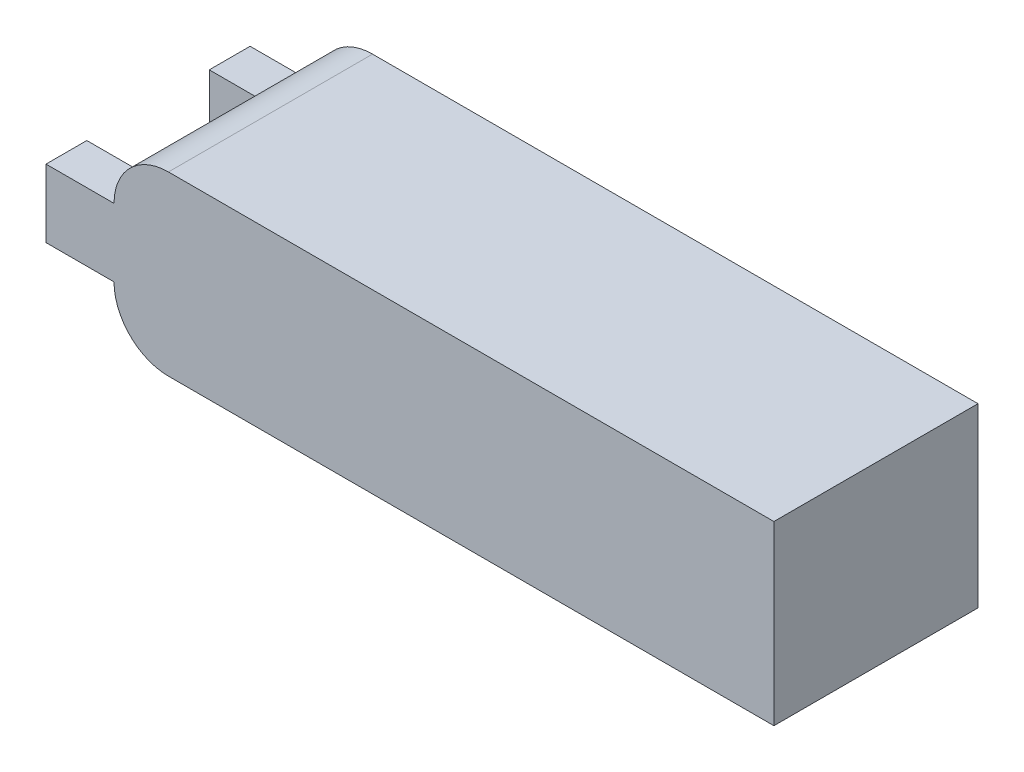
ISO-10303-21;
HEADER;
FILE_DESCRIPTION(('STEP AP214'),'2;1');
FILE_NAME('part.step','',(''),(''),'','','');
FILE_SCHEMA(('AUTOMOTIVE_DESIGN { 1 0 10303 214 1 1 1 1 }'));
ENDSEC;
DATA;
#1=APPLICATION_CONTEXT('core data for automotive mechanical design processes');
#2=APPLICATION_PROTOCOL_DEFINITION('international standard','automotive_design',2000,#1);
#3=PRODUCT_CONTEXT('',#1,'mechanical');
#4=PRODUCT('Part','Part','',(#3));
#5=PRODUCT_RELATED_PRODUCT_CATEGORY('part','',(#4));
#6=PRODUCT_DEFINITION_FORMATION('','',#4);
#7=PRODUCT_DEFINITION_CONTEXT('part definition',#1,'design');
#8=PRODUCT_DEFINITION('design','',#6,#7);
#9=PRODUCT_DEFINITION_SHAPE('','',#8);
#10=(LENGTH_UNIT() NAMED_UNIT(*) SI_UNIT(.MILLI.,.METRE.));
#11=(NAMED_UNIT(*) PLANE_ANGLE_UNIT() SI_UNIT($,.RADIAN.));
#12=(NAMED_UNIT(*) SI_UNIT($,.STERADIAN.) SOLID_ANGLE_UNIT());
#13=UNCERTAINTY_MEASURE_WITH_UNIT(LENGTH_MEASURE(1.E-05),#10,'distance_accuracy_value','');
#14=(GEOMETRIC_REPRESENTATION_CONTEXT(3) GLOBAL_UNCERTAINTY_ASSIGNED_CONTEXT((#13)) GLOBAL_UNIT_ASSIGNED_CONTEXT((#10,
#11,#12)) REPRESENTATION_CONTEXT('',''));
#15=CARTESIAN_POINT('',(0.,0.,0.));
#16=DIRECTION('',(0.,0.,1.));
#17=DIRECTION('',(1.,0.,0.));
#18=AXIS2_PLACEMENT_3D('',#15,#16,#17);
#19=CARTESIAN_POINT('',(0.,26.,0.));
#20=DIRECTION('',(1.,0.,0.));
#21=DIRECTION('',(0.,0.,-1.));
#22=AXIS2_PLACEMENT_3D('',#19,#20,#21);
#23=PLANE('',#22);
#24=DIRECTION('',(0.,-1.,0.));
#25=VECTOR('',#24,1.);
#26=CARTESIAN_POINT('',(0.,18.,-6.));
#27=LINE('',#26,#25);
#28=CARTESIAN_POINT('',(0.,18.,-6.));
#29=VERTEX_POINT('',#28);
#30=CARTESIAN_POINT('',(0.,8.,-6.));
#31=VERTEX_POINT('',#30);
#32=EDGE_CURVE('E282',#29,#31,#27,.T.);
#33=ORIENTED_EDGE('',*,*,#32,.F.);
#34=DIRECTION('',(0.,0.,1.));
#35=VECTOR('',#34,1.);
#36=CARTESIAN_POINT('',(0.,18.,0.));
#37=LINE('',#36,#35);
#38=CARTESIAN_POINT('',(1.2490009027033E-13,18.,-24.));
#39=VERTEX_POINT('',#38);
#40=EDGE_CURVE('E196',#29,#39,#37,.F.);
#41=ORIENTED_EDGE('',*,*,#40,.T.);
#42=DIRECTION('',(0.,1.,0.));
#43=VECTOR('',#42,1.);
#44=CARTESIAN_POINT('',(1.2490009027033E-13,18.,-24.));
#45=LINE('',#44,#43);
#46=CARTESIAN_POINT('',(1.2490009027033E-13,8.,-24.));
#47=VERTEX_POINT('',#46);
#48=EDGE_CURVE('E54',#47,#39,#45,.T.);
#49=ORIENTED_EDGE('',*,*,#48,.F.);
#50=DIRECTION('',(0.,0.,1.));
#51=VECTOR('',#50,1.);
#52=CARTESIAN_POINT('',(0.,8.,0.));
#53=LINE('',#52,#51);
#54=EDGE_CURVE('E199',#47,#31,#53,.T.);
#55=ORIENTED_EDGE('',*,*,#54,.T.);
#56=EDGE_LOOP('',(#33,#41,#49,#55));
#57=FACE_BOUND('',#56,.T.);
#58=ADVANCED_FACE('F32',(#57),#23,.F.);
#59=CARTESIAN_POINT('',(0.,26.,0.));
#60=DIRECTION('',(0.,0.,-1.));
#61=DIRECTION('',(-1.,0.,0.));
#62=AXIS2_PLACEMENT_3D('',#59,#60,#61);
#63=PLANE('',#62);
#64=CARTESIAN_POINT('',(7.99999999999999,18.,0.));
#65=DIRECTION('',(0.,0.,-1.));
#66=DIRECTION('',(-1.,0.,0.));
#67=AXIS2_PLACEMENT_3D('',#64,#65,#66);
#68=CIRCLE('',#67,8.);
#69=CARTESIAN_POINT('',(7.99999999999999,26.,0.));
#70=VERTEX_POINT('',#69);
#71=CARTESIAN_POINT('',(0.,18.,0.));
#72=VERTEX_POINT('',#71);
#73=EDGE_CURVE('E144',#70,#72,#68,.F.);
#74=ORIENTED_EDGE('',*,*,#73,.T.);
#75=DIRECTION('',(1.,0.,0.));
#76=VECTOR('',#75,1.);
#77=CARTESIAN_POINT('',(-9.99999999999999,18.,0.));
#78=LINE('',#77,#76);
#79=CARTESIAN_POINT('',(-9.99999999999999,18.,0.));
#80=VERTEX_POINT('',#79);
#81=EDGE_CURVE('E126',#80,#72,#78,.T.);
#82=ORIENTED_EDGE('',*,*,#81,.F.);
#83=DIRECTION('',(0.,1.,0.));
#84=VECTOR('',#83,1.);
#85=CARTESIAN_POINT('',(-9.99999999999999,18.,0.));
#86=LINE('',#85,#84);
#87=CARTESIAN_POINT('',(-9.99999999999999,8.00000000000001,0.));
#88=VERTEX_POINT('',#87);
#89=EDGE_CURVE('E132',#88,#80,#86,.T.);
#90=ORIENTED_EDGE('',*,*,#89,.F.);
#91=DIRECTION('',(1.,0.,0.));
#92=VECTOR('',#91,1.);
#93=CARTESIAN_POINT('',(-9.99999999999999,8.00000000000001,0.));
#94=LINE('',#93,#92);
#95=CARTESIAN_POINT('',(0.,8.00000000000001,0.));
#96=VERTEX_POINT('',#95);
#97=EDGE_CURVE('E280',#88,#96,#94,.T.);
#98=ORIENTED_EDGE('',*,*,#97,.T.);
#99=CARTESIAN_POINT('',(7.99999999999999,8.,0.));
#100=DIRECTION('',(0.,0.,-1.));
#101=DIRECTION('',(-1.,0.,0.));
#102=AXIS2_PLACEMENT_3D('',#99,#100,#101);
#103=CIRCLE('',#102,8.);
#104=CARTESIAN_POINT('',(7.99999999999999,0.,0.));
#105=VERTEX_POINT('',#104);
#106=EDGE_CURVE('E204',#96,#105,#103,.F.);
#107=ORIENTED_EDGE('',*,*,#106,.T.);
#108=DIRECTION('',(1.,0.,0.));
#109=VECTOR('',#108,1.);
#110=CARTESIAN_POINT('',(0.,0.,0.));
#111=LINE('',#110,#109);
#112=CARTESIAN_POINT('',(97.,0.,0.));
#113=VERTEX_POINT('',#112);
#114=EDGE_CURVE('E176',#105,#113,#111,.T.);
#115=ORIENTED_EDGE('',*,*,#114,.T.);
#116=DIRECTION('',(0.,-1.,0.));
#117=VECTOR('',#116,1.);
#118=CARTESIAN_POINT('',(97.,26.,0.));
#119=LINE('',#118,#117);
#120=CARTESIAN_POINT('',(97.,26.,0.));
#121=VERTEX_POINT('',#120);
#122=EDGE_CURVE('E193',#121,#113,#119,.T.);
#123=ORIENTED_EDGE('',*,*,#122,.F.);
#124=DIRECTION('',(1.,0.,0.));
#125=VECTOR('',#124,1.);
#126=CARTESIAN_POINT('',(0.,26.,0.));
#127=LINE('',#126,#125);
#128=EDGE_CURVE('E177',#70,#121,#127,.T.);
#129=ORIENTED_EDGE('',*,*,#128,.F.);
#130=EDGE_LOOP('',(#74,#82,#90,#98,#107,#115,#123,#129));
#131=FACE_BOUND('',#130,.T.);
#132=ADVANCED_FACE('F142',(#131),#63,.F.);
#133=CARTESIAN_POINT('',(97.,26.,0.));
#134=DIRECTION('',(-1.,0.,0.));
#135=DIRECTION('',(0.,0.,1.));
#136=AXIS2_PLACEMENT_3D('',#133,#134,#135);
#137=PLANE('',#136);
#138=DIRECTION('',(0.,0.,-1.));
#139=VECTOR('',#138,1.);
#140=CARTESIAN_POINT('',(97.,0.,0.));
#141=LINE('',#140,#139);
#142=CARTESIAN_POINT('',(97.,0.,-30.));
#143=VERTEX_POINT('',#142);
#144=EDGE_CURVE('E187',#113,#143,#141,.T.);
#145=ORIENTED_EDGE('',*,*,#144,.T.);
#146=DIRECTION('',(0.,-1.,0.));
#147=VECTOR('',#146,1.);
#148=CARTESIAN_POINT('',(97.,26.,-30.));
#149=LINE('',#148,#147);
#150=CARTESIAN_POINT('',(97.,26.,-30.));
#151=VERTEX_POINT('',#150);
#152=EDGE_CURVE('E185',#151,#143,#149,.T.);
#153=ORIENTED_EDGE('',*,*,#152,.F.);
#154=DIRECTION('',(0.,0.,-1.));
#155=VECTOR('',#154,1.);
#156=CARTESIAN_POINT('',(97.,26.,0.));
#157=LINE('',#156,#155);
#158=EDGE_CURVE('E179',#121,#151,#157,.T.);
#159=ORIENTED_EDGE('',*,*,#158,.F.);
#160=ORIENTED_EDGE('',*,*,#122,.T.);
#161=EDGE_LOOP('',(#145,#153,#159,#160));
#162=FACE_BOUND('',#161,.T.);
#163=ADVANCED_FACE('F249',(#162),#137,.F.);
#164=CARTESIAN_POINT('',(0.,26.,-30.));
#165=DIRECTION('',(0.,0.,1.));
#166=DIRECTION('',(1.,0.,0.));
#167=AXIS2_PLACEMENT_3D('',#164,#165,#166);
#168=PLANE('',#167);
#169=DIRECTION('',(-1.,0.,0.));
#170=VECTOR('',#169,1.);
#171=CARTESIAN_POINT('',(0.,0.,-30.));
#172=LINE('',#171,#170);
#173=CARTESIAN_POINT('',(8.00000000000001,0.,-30.));
#174=VERTEX_POINT('',#173);
#175=EDGE_CURVE('E180',#143,#174,#172,.T.);
#176=ORIENTED_EDGE('',*,*,#175,.T.);
#177=CARTESIAN_POINT('',(8.00000000000001,8.,-30.));
#178=DIRECTION('',(0.,0.,1.));
#179=DIRECTION('',(1.,0.,0.));
#180=AXIS2_PLACEMENT_3D('',#177,#178,#179);
#181=CIRCLE('',#180,8.);
#182=CARTESIAN_POINT('',(0.,8.00000000000001,-30.));
#183=VERTEX_POINT('',#182);
#184=EDGE_CURVE('E40',#174,#183,#181,.F.);
#185=ORIENTED_EDGE('',*,*,#184,.T.);
#186=DIRECTION('',(1.,0.,0.));
#187=VECTOR('',#186,1.);
#188=CARTESIAN_POINT('',(-9.99999999999999,8.00000000000001,-30.));
#189=LINE('',#188,#187);
#190=CARTESIAN_POINT('',(-9.99999999999999,8.00000000000001,-30.));
#191=VERTEX_POINT('',#190);
#192=EDGE_CURVE('E173',#191,#183,#189,.T.);
#193=ORIENTED_EDGE('',*,*,#192,.F.);
#194=DIRECTION('',(0.,-1.,0.));
#195=VECTOR('',#194,1.);
#196=CARTESIAN_POINT('',(-9.99999999999999,18.,-30.));
#197=LINE('',#196,#195);
#198=CARTESIAN_POINT('',(-9.99999999999999,18.,-30.));
#199=VERTEX_POINT('',#198);
#200=EDGE_CURVE('E153',#199,#191,#197,.T.);
#201=ORIENTED_EDGE('',*,*,#200,.F.);
#202=DIRECTION('',(1.,0.,0.));
#203=VECTOR('',#202,1.);
#204=CARTESIAN_POINT('',(-9.99999999999999,18.,-30.));
#205=LINE('',#204,#203);
#206=CARTESIAN_POINT('',(0.,18.,-30.));
#207=VERTEX_POINT('',#206);
#208=EDGE_CURVE('E161',#199,#207,#205,.T.);
#209=ORIENTED_EDGE('',*,*,#208,.T.);
#210=CARTESIAN_POINT('',(8.00000000000001,18.,-30.));
#211=DIRECTION('',(0.,0.,1.));
#212=DIRECTION('',(1.,0.,0.));
#213=AXIS2_PLACEMENT_3D('',#210,#211,#212);
#214=CIRCLE('',#213,8.);
#215=CARTESIAN_POINT('',(8.00000000000001,26.,-30.));
#216=VERTEX_POINT('',#215);
#217=EDGE_CURVE('E208',#207,#216,#214,.F.);
#218=ORIENTED_EDGE('',*,*,#217,.T.);
#219=DIRECTION('',(-1.,0.,0.));
#220=VECTOR('',#219,1.);
#221=CARTESIAN_POINT('',(0.,26.,-30.));
#222=LINE('',#221,#220);
#223=EDGE_CURVE('E182',#151,#216,#222,.T.);
#224=ORIENTED_EDGE('',*,*,#223,.F.);
#225=ORIENTED_EDGE('',*,*,#152,.T.);
#226=EDGE_LOOP('',(#176,#185,#193,#201,#209,#218,#224,#225));
#227=FACE_BOUND('',#226,.T.);
#228=ADVANCED_FACE('F213',(#227),#168,.F.);
#229=CARTESIAN_POINT('',(0.,26.,0.));
#230=DIRECTION('',(0.,-1.,0.));
#231=DIRECTION('',(0.,0.,-1.));
#232=AXIS2_PLACEMENT_3D('',#229,#230,#231);
#233=PLANE('',#232);
#234=ORIENTED_EDGE('',*,*,#223,.T.);
#235=DIRECTION('',(0.,0.,1.));
#236=VECTOR('',#235,1.);
#237=CARTESIAN_POINT('',(7.99999999999999,26.,0.));
#238=LINE('',#237,#236);
#239=EDGE_CURVE('E11',#216,#70,#238,.T.);
#240=ORIENTED_EDGE('',*,*,#239,.T.);
#241=ORIENTED_EDGE('',*,*,#128,.T.);
#242=ORIENTED_EDGE('',*,*,#158,.T.);
#243=EDGE_LOOP('',(#234,#240,#241,#242));
#244=FACE_BOUND('',#243,.T.);
#245=ADVANCED_FACE('F258',(#244),#233,.F.);
#246=CARTESIAN_POINT('',(0.,0.,0.));
#247=DIRECTION('',(0.,-1.,0.));
#248=DIRECTION('',(0.,0.,-1.));
#249=AXIS2_PLACEMENT_3D('',#246,#247,#248);
#250=PLANE('',#249);
#251=ORIENTED_EDGE('',*,*,#114,.F.);
#252=DIRECTION('',(0.,0.,1.));
#253=VECTOR('',#252,1.);
#254=CARTESIAN_POINT('',(8.00000000000001,0.,-30.));
#255=LINE('',#254,#253);
#256=EDGE_CURVE('E206',#105,#174,#255,.F.);
#257=ORIENTED_EDGE('',*,*,#256,.T.);
#258=ORIENTED_EDGE('',*,*,#175,.F.);
#259=ORIENTED_EDGE('',*,*,#144,.F.);
#260=EDGE_LOOP('',(#251,#257,#258,#259));
#261=FACE_BOUND('',#260,.T.);
#262=ADVANCED_FACE('F253',(#261),#250,.T.);
#263=CARTESIAN_POINT('',(7.99999999999999,8.,0.));
#264=DIRECTION('',(0.,0.,-1.));
#265=DIRECTION('',(-1.,0.,0.));
#266=AXIS2_PLACEMENT_3D('',#263,#264,#265);
#267=CYLINDRICAL_SURFACE('',#266,8.);
#268=ORIENTED_EDGE('',*,*,#184,.F.);
#269=ORIENTED_EDGE('',*,*,#256,.F.);
#270=ORIENTED_EDGE('',*,*,#106,.F.);
#271=DIRECTION('',(0.,0.,1.));
#272=VECTOR('',#271,1.);
#273=CARTESIAN_POINT('',(0.,8.00000000000001,0.));
#274=LINE('',#273,#272);
#275=EDGE_CURVE('E47',#31,#96,#274,.T.);
#276=ORIENTED_EDGE('',*,*,#275,.F.);
#277=ORIENTED_EDGE('',*,*,#54,.F.);
#278=EDGE_CURVE('E200',#183,#47,#53,.T.);
#279=ORIENTED_EDGE('',*,*,#278,.F.);
#280=EDGE_LOOP('',(#268,#269,#270,#276,#277,#279));
#281=FACE_BOUND('',#280,.T.);
#282=ADVANCED_FACE('F217',(#281),#267,.T.);
#283=CARTESIAN_POINT('',(7.99999999999999,18.,0.));
#284=DIRECTION('',(0.,0.,1.));
#285=DIRECTION('',(1.,0.,0.));
#286=AXIS2_PLACEMENT_3D('',#283,#284,#285);
#287=CYLINDRICAL_SURFACE('',#286,8.);
#288=ORIENTED_EDGE('',*,*,#217,.F.);
#289=DIRECTION('',(0.,0.,-1.));
#290=VECTOR('',#289,1.);
#291=CARTESIAN_POINT('',(0.,18.,-30.));
#292=LINE('',#291,#290);
#293=EDGE_CURVE('E147',#39,#207,#292,.T.);
#294=ORIENTED_EDGE('',*,*,#293,.F.);
#295=ORIENTED_EDGE('',*,*,#40,.F.);
#296=EDGE_CURVE('E197',#72,#29,#37,.F.);
#297=ORIENTED_EDGE('',*,*,#296,.F.);
#298=ORIENTED_EDGE('',*,*,#73,.F.);
#299=ORIENTED_EDGE('',*,*,#239,.F.);
#300=EDGE_LOOP('',(#288,#294,#295,#297,#298,#299));
#301=FACE_BOUND('',#300,.T.);
#302=ADVANCED_FACE('F34',(#301),#287,.T.);
#303=CARTESIAN_POINT('',(-9.99999999999999,8.00000000000001,-30.));
#304=DIRECTION('',(0.,1.,0.));
#305=DIRECTION('',(0.,0.,1.));
#306=AXIS2_PLACEMENT_3D('',#303,#304,#305);
#307=PLANE('',#306);
#308=ORIENTED_EDGE('',*,*,#278,.T.);
#309=DIRECTION('',(1.,0.,0.));
#310=VECTOR('',#309,1.);
#311=CARTESIAN_POINT('',(-9.99999999999987,8.00000000000001,-24.));
#312=LINE('',#311,#310);
#313=CARTESIAN_POINT('',(-9.99999999999987,8.00000000000001,-24.));
#314=VERTEX_POINT('',#313);
#315=EDGE_CURVE('E170',#314,#47,#312,.T.);
#316=ORIENTED_EDGE('',*,*,#315,.F.);
#317=DIRECTION('',(0.,0.,1.));
#318=VECTOR('',#317,1.);
#319=CARTESIAN_POINT('',(-9.99999999999999,8.00000000000001,-30.));
#320=LINE('',#319,#318);
#321=EDGE_CURVE('E156',#191,#314,#320,.T.);
#322=ORIENTED_EDGE('',*,*,#321,.F.);
#323=ORIENTED_EDGE('',*,*,#192,.T.);
#324=EDGE_LOOP('',(#308,#316,#322,#323));
#325=FACE_BOUND('',#324,.T.);
#326=ADVANCED_FACE('F220',(#325),#307,.F.);
#327=CARTESIAN_POINT('',(-9.99999999999987,18.,-24.));
#328=DIRECTION('',(0.,0.,-1.));
#329=DIRECTION('',(-1.,0.,0.));
#330=AXIS2_PLACEMENT_3D('',#327,#328,#329);
#331=PLANE('',#330);
#332=ORIENTED_EDGE('',*,*,#48,.T.);
#333=DIRECTION('',(1.,0.,0.));
#334=VECTOR('',#333,1.);
#335=CARTESIAN_POINT('',(-9.99999999999987,18.,-24.));
#336=LINE('',#335,#334);
#337=CARTESIAN_POINT('',(-9.99999999999987,18.,-24.));
#338=VERTEX_POINT('',#337);
#339=EDGE_CURVE('E167',#338,#39,#336,.T.);
#340=ORIENTED_EDGE('',*,*,#339,.F.);
#341=DIRECTION('',(0.,1.,0.));
#342=VECTOR('',#341,1.);
#343=CARTESIAN_POINT('',(-9.99999999999987,18.,-24.));
#344=LINE('',#343,#342);
#345=EDGE_CURVE('E158',#314,#338,#344,.T.);
#346=ORIENTED_EDGE('',*,*,#345,.F.);
#347=ORIENTED_EDGE('',*,*,#315,.T.);
#348=EDGE_LOOP('',(#332,#340,#346,#347));
#349=FACE_BOUND('',#348,.T.);
#350=ADVANCED_FACE('F235',(#349),#331,.F.);
#351=CARTESIAN_POINT('',(-9.99999999999999,18.,-30.));
#352=DIRECTION('',(0.,-1.,0.));
#353=DIRECTION('',(0.,0.,-1.));
#354=AXIS2_PLACEMENT_3D('',#351,#352,#353);
#355=PLANE('',#354);
#356=ORIENTED_EDGE('',*,*,#293,.T.);
#357=ORIENTED_EDGE('',*,*,#208,.F.);
#358=DIRECTION('',(0.,0.,-1.));
#359=VECTOR('',#358,1.);
#360=CARTESIAN_POINT('',(-9.99999999999999,18.,-30.));
#361=LINE('',#360,#359);
#362=EDGE_CURVE('E160',#338,#199,#361,.T.);
#363=ORIENTED_EDGE('',*,*,#362,.F.);
#364=ORIENTED_EDGE('',*,*,#339,.T.);
#365=EDGE_LOOP('',(#356,#357,#363,#364));
#366=FACE_BOUND('',#365,.T.);
#367=ADVANCED_FACE('F228',(#366),#355,.F.);
#368=CARTESIAN_POINT('',(-9.99999999999999,0.,0.));
#369=DIRECTION('',(-1.,0.,0.));
#370=DIRECTION('',(0.,0.,1.));
#371=AXIS2_PLACEMENT_3D('',#368,#369,#370);
#372=PLANE('',#371);
#373=ORIENTED_EDGE('',*,*,#200,.T.);
#374=ORIENTED_EDGE('',*,*,#321,.T.);
#375=ORIENTED_EDGE('',*,*,#345,.T.);
#376=ORIENTED_EDGE('',*,*,#362,.T.);
#377=EDGE_LOOP('',(#373,#374,#375,#376));
#378=FACE_BOUND('',#377,.T.);
#379=ADVANCED_FACE('F223',(#378),#372,.T.);
#380=CARTESIAN_POINT('',(-9.99999999999999,18.,0.));
#381=DIRECTION('',(0.,-1.,0.));
#382=DIRECTION('',(0.,0.,-1.));
#383=AXIS2_PLACEMENT_3D('',#380,#381,#382);
#384=PLANE('',#383);
#385=ORIENTED_EDGE('',*,*,#296,.T.);
#386=DIRECTION('',(1.,0.,0.));
#387=VECTOR('',#386,1.);
#388=CARTESIAN_POINT('',(-9.99999999999998,18.,-6.));
#389=LINE('',#388,#387);
#390=CARTESIAN_POINT('',(-9.99999999999998,18.,-6.));
#391=VERTEX_POINT('',#390);
#392=EDGE_CURVE('E128',#391,#29,#389,.T.);
#393=ORIENTED_EDGE('',*,*,#392,.F.);
#394=DIRECTION('',(0.,0.,-1.));
#395=VECTOR('',#394,1.);
#396=CARTESIAN_POINT('',(-9.99999999999999,18.,0.));
#397=LINE('',#396,#395);
#398=EDGE_CURVE('E121',#80,#391,#397,.T.);
#399=ORIENTED_EDGE('',*,*,#398,.F.);
#400=ORIENTED_EDGE('',*,*,#81,.T.);
#401=EDGE_LOOP('',(#385,#393,#399,#400));
#402=FACE_BOUND('',#401,.T.);
#403=ADVANCED_FACE('F124',(#402),#384,.F.);
#404=CARTESIAN_POINT('',(-9.99999999999998,18.,-6.));
#405=DIRECTION('',(0.,0.,1.));
#406=DIRECTION('',(1.,0.,0.));
#407=AXIS2_PLACEMENT_3D('',#404,#405,#406);
#408=PLANE('',#407);
#409=ORIENTED_EDGE('',*,*,#32,.T.);
#410=DIRECTION('',(1.,0.,0.));
#411=VECTOR('',#410,1.);
#412=CARTESIAN_POINT('',(-9.99999999999998,8.00000000000001,-6.));
#413=LINE('',#412,#411);
#414=CARTESIAN_POINT('',(-9.99999999999998,8.00000000000001,-6.));
#415=VERTEX_POINT('',#414);
#416=EDGE_CURVE('E149',#415,#31,#413,.T.);
#417=ORIENTED_EDGE('',*,*,#416,.F.);
#418=DIRECTION('',(0.,-1.,0.));
#419=VECTOR('',#418,1.);
#420=CARTESIAN_POINT('',(-9.99999999999998,18.,-6.));
#421=LINE('',#420,#419);
#422=EDGE_CURVE('E131',#391,#415,#421,.T.);
#423=ORIENTED_EDGE('',*,*,#422,.F.);
#424=ORIENTED_EDGE('',*,*,#392,.T.);
#425=EDGE_LOOP('',(#409,#417,#423,#424));
#426=FACE_BOUND('',#425,.T.);
#427=ADVANCED_FACE('F290',(#426),#408,.F.);
#428=CARTESIAN_POINT('',(-9.99999999999999,8.00000000000001,0.));
#429=DIRECTION('',(0.,1.,0.));
#430=DIRECTION('',(0.,0.,1.));
#431=AXIS2_PLACEMENT_3D('',#428,#429,#430);
#432=PLANE('',#431);
#433=ORIENTED_EDGE('',*,*,#275,.T.);
#434=ORIENTED_EDGE('',*,*,#97,.F.);
#435=DIRECTION('',(0.,0.,1.));
#436=VECTOR('',#435,1.);
#437=CARTESIAN_POINT('',(-9.99999999999999,8.00000000000001,0.));
#438=LINE('',#437,#436);
#439=EDGE_CURVE('E137',#415,#88,#438,.T.);
#440=ORIENTED_EDGE('',*,*,#439,.F.);
#441=ORIENTED_EDGE('',*,*,#416,.T.);
#442=EDGE_LOOP('',(#433,#434,#440,#441));
#443=FACE_BOUND('',#442,.T.);
#444=ADVANCED_FACE('F279',(#443),#432,.F.);
#445=CARTESIAN_POINT('',(-9.99999999999999,0.,0.));
#446=DIRECTION('',(1.,0.,0.));
#447=DIRECTION('',(0.,0.,-1.));
#448=AXIS2_PLACEMENT_3D('',#445,#446,#447);
#449=PLANE('',#448);
#450=ORIENTED_EDGE('',*,*,#89,.T.);
#451=ORIENTED_EDGE('',*,*,#398,.T.);
#452=ORIENTED_EDGE('',*,*,#422,.T.);
#453=ORIENTED_EDGE('',*,*,#439,.T.);
#454=EDGE_LOOP('',(#450,#451,#452,#453));
#455=FACE_BOUND('',#454,.T.);
#456=ADVANCED_FACE('F135',(#455),#449,.F.);
#457=CLOSED_SHELL('',(#58,#132,#163,#228,#245,#262,#282,#302,#326,#350,#367,#379,#403,#427,#444,#456));
#458=MANIFOLD_SOLID_BREP('B2',#457);
#459=ADVANCED_BREP_SHAPE_REPRESENTATION('',(#18,#458),#14);
#460=SHAPE_DEFINITION_REPRESENTATION(#9,#459);
ENDSEC;
END-ISO-10303-21;
